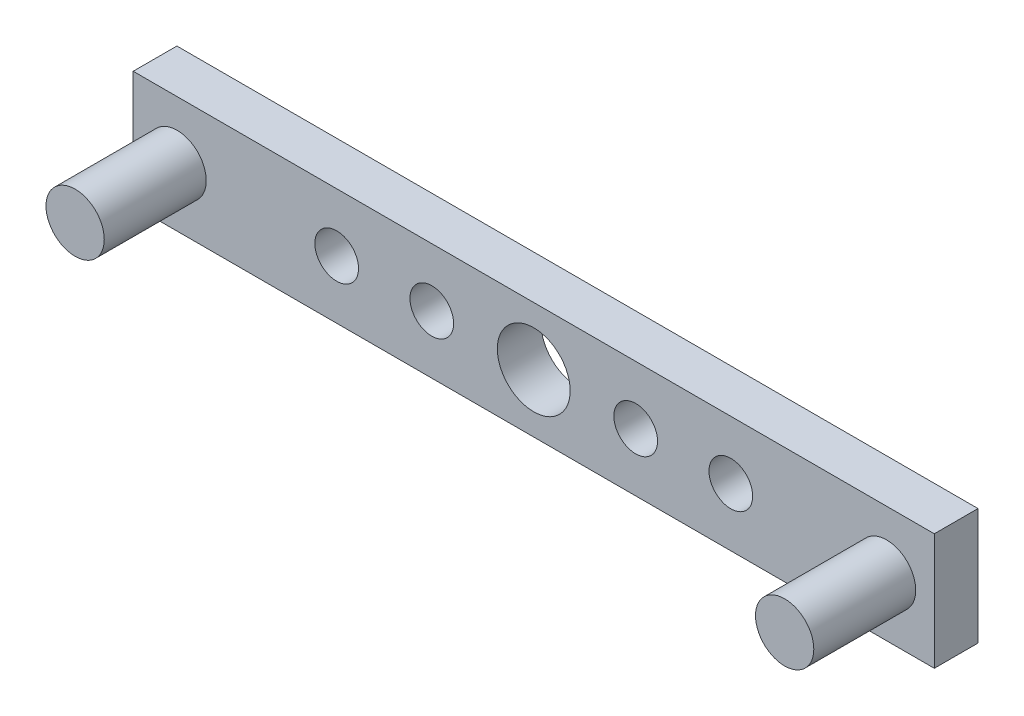
ISO-10303-21;
HEADER;
FILE_DESCRIPTION(('STEP AP214'),'2;1');
FILE_NAME('part.step','',(''),(''),'','','');
FILE_SCHEMA(('AUTOMOTIVE_DESIGN { 1 0 10303 214 1 1 1 1 }'));
ENDSEC;
DATA;
#1=APPLICATION_CONTEXT('core data for automotive mechanical design processes');
#2=APPLICATION_PROTOCOL_DEFINITION('international standard','automotive_design',2000,#1);
#3=PRODUCT_CONTEXT('',#1,'mechanical');
#4=PRODUCT('Part','Part','',(#3));
#5=PRODUCT_RELATED_PRODUCT_CATEGORY('part','',(#4));
#6=PRODUCT_DEFINITION_FORMATION('','',#4);
#7=PRODUCT_DEFINITION_CONTEXT('part definition',#1,'design');
#8=PRODUCT_DEFINITION('design','',#6,#7);
#9=PRODUCT_DEFINITION_SHAPE('','',#8);
#10=(LENGTH_UNIT() NAMED_UNIT(*) SI_UNIT(.MILLI.,.METRE.));
#11=(NAMED_UNIT(*) PLANE_ANGLE_UNIT() SI_UNIT($,.RADIAN.));
#12=(NAMED_UNIT(*) SI_UNIT($,.STERADIAN.) SOLID_ANGLE_UNIT());
#13=UNCERTAINTY_MEASURE_WITH_UNIT(LENGTH_MEASURE(1.E-05),#10,'distance_accuracy_value','');
#14=(GEOMETRIC_REPRESENTATION_CONTEXT(3) GLOBAL_UNCERTAINTY_ASSIGNED_CONTEXT((#13)) GLOBAL_UNIT_ASSIGNED_CONTEXT((#10,
#11,#12)) REPRESENTATION_CONTEXT('',''));
#15=CARTESIAN_POINT('',(0.,0.,0.));
#16=DIRECTION('',(0.,0.,1.));
#17=DIRECTION('',(1.,0.,0.));
#18=AXIS2_PLACEMENT_3D('',#15,#16,#17);
#19=CARTESIAN_POINT('',(0.,0.,3.));
#20=DIRECTION('',(1.,0.,0.));
#21=DIRECTION('',(0.,0.,-1.));
#22=AXIS2_PLACEMENT_3D('',#19,#20,#21);
#23=PLANE('',#22);
#24=DIRECTION('',(0.,-1.,0.));
#25=VECTOR('',#24,1.);
#26=CARTESIAN_POINT('',(0.,0.,0.));
#27=LINE('',#26,#25);
#28=CARTESIAN_POINT('',(0.,8.,0.));
#29=VERTEX_POINT('',#28);
#30=CARTESIAN_POINT('',(0.,0.,0.));
#31=VERTEX_POINT('',#30);
#32=EDGE_CURVE('E111',#29,#31,#27,.T.);
#33=ORIENTED_EDGE('',*,*,#32,.T.);
#34=DIRECTION('',(0.,0.,-1.));
#35=VECTOR('',#34,1.);
#36=CARTESIAN_POINT('',(0.,0.,3.));
#37=LINE('',#36,#35);
#38=CARTESIAN_POINT('',(0.,0.,3.));
#39=VERTEX_POINT('',#38);
#40=EDGE_CURVE('E42',#39,#31,#37,.T.);
#41=ORIENTED_EDGE('',*,*,#40,.F.);
#42=DIRECTION('',(0.,-1.,0.));
#43=VECTOR('',#42,1.);
#44=CARTESIAN_POINT('',(0.,0.,3.));
#45=LINE('',#44,#43);
#46=CARTESIAN_POINT('',(0.,8.,3.));
#47=VERTEX_POINT('',#46);
#48=EDGE_CURVE('E94',#47,#39,#45,.T.);
#49=ORIENTED_EDGE('',*,*,#48,.F.);
#50=DIRECTION('',(0.,0.,-1.));
#51=VECTOR('',#50,1.);
#52=CARTESIAN_POINT('',(0.,8.,3.));
#53=LINE('',#52,#51);
#54=EDGE_CURVE('E107',#47,#29,#53,.T.);
#55=ORIENTED_EDGE('',*,*,#54,.T.);
#56=EDGE_LOOP('',(#33,#41,#49,#55));
#57=FACE_BOUND('',#56,.T.);
#58=ADVANCED_FACE('F39',(#57),#23,.F.);
#59=CARTESIAN_POINT('',(0.,0.,3.));
#60=DIRECTION('',(0.,1.,0.));
#61=DIRECTION('',(0.,0.,1.));
#62=AXIS2_PLACEMENT_3D('',#59,#60,#61);
#63=PLANE('',#62);
#64=DIRECTION('',(1.,0.,0.));
#65=VECTOR('',#64,1.);
#66=CARTESIAN_POINT('',(0.,0.,0.));
#67=LINE('',#66,#65);
#68=CARTESIAN_POINT('',(55.,0.,0.));
#69=VERTEX_POINT('',#68);
#70=EDGE_CURVE('E100',#31,#69,#67,.T.);
#71=ORIENTED_EDGE('',*,*,#70,.T.);
#72=DIRECTION('',(0.,0.,-1.));
#73=VECTOR('',#72,1.);
#74=CARTESIAN_POINT('',(55.,0.,3.));
#75=LINE('',#74,#73);
#76=CARTESIAN_POINT('',(55.,0.,3.));
#77=VERTEX_POINT('',#76);
#78=EDGE_CURVE('E98',#77,#69,#75,.T.);
#79=ORIENTED_EDGE('',*,*,#78,.F.);
#80=DIRECTION('',(1.,0.,0.));
#81=VECTOR('',#80,1.);
#82=CARTESIAN_POINT('',(0.,0.,3.));
#83=LINE('',#82,#81);
#84=EDGE_CURVE('E89',#39,#77,#83,.T.);
#85=ORIENTED_EDGE('',*,*,#84,.F.);
#86=ORIENTED_EDGE('',*,*,#40,.T.);
#87=EDGE_LOOP('',(#71,#79,#85,#86));
#88=FACE_BOUND('',#87,.T.);
#89=ADVANCED_FACE('F99',(#88),#63,.F.);
#90=CARTESIAN_POINT('',(55.,0.,3.));
#91=DIRECTION('',(-1.,0.,0.));
#92=DIRECTION('',(0.,0.,1.));
#93=AXIS2_PLACEMENT_3D('',#90,#91,#92);
#94=PLANE('',#93);
#95=DIRECTION('',(0.,1.,0.));
#96=VECTOR('',#95,1.);
#97=CARTESIAN_POINT('',(55.,0.,0.));
#98=LINE('',#97,#96);
#99=CARTESIAN_POINT('',(55.,8.,0.));
#100=VERTEX_POINT('',#99);
#101=EDGE_CURVE('E75',#69,#100,#98,.T.);
#102=ORIENTED_EDGE('',*,*,#101,.T.);
#103=DIRECTION('',(0.,0.,-1.));
#104=VECTOR('',#103,1.);
#105=CARTESIAN_POINT('',(55.,8.,3.));
#106=LINE('',#105,#104);
#107=CARTESIAN_POINT('',(55.,8.,3.));
#108=VERTEX_POINT('',#107);
#109=EDGE_CURVE('E102',#108,#100,#106,.T.);
#110=ORIENTED_EDGE('',*,*,#109,.F.);
#111=DIRECTION('',(0.,1.,0.));
#112=VECTOR('',#111,1.);
#113=CARTESIAN_POINT('',(55.,0.,3.));
#114=LINE('',#113,#112);
#115=EDGE_CURVE('E92',#77,#108,#114,.T.);
#116=ORIENTED_EDGE('',*,*,#115,.F.);
#117=ORIENTED_EDGE('',*,*,#78,.T.);
#118=EDGE_LOOP('',(#102,#110,#116,#117));
#119=FACE_BOUND('',#118,.T.);
#120=ADVANCED_FACE('F103',(#119),#94,.F.);
#121=CARTESIAN_POINT('',(0.,8.,3.));
#122=DIRECTION('',(0.,-1.,0.));
#123=DIRECTION('',(0.,0.,-1.));
#124=AXIS2_PLACEMENT_3D('',#121,#122,#123);
#125=PLANE('',#124);
#126=DIRECTION('',(-1.,0.,0.));
#127=VECTOR('',#126,1.);
#128=CARTESIAN_POINT('',(0.,8.,0.));
#129=LINE('',#128,#127);
#130=EDGE_CURVE('E81',#100,#29,#129,.T.);
#131=ORIENTED_EDGE('',*,*,#130,.T.);
#132=ORIENTED_EDGE('',*,*,#54,.F.);
#133=DIRECTION('',(-1.,0.,0.));
#134=VECTOR('',#133,1.);
#135=CARTESIAN_POINT('',(0.,8.,3.));
#136=LINE('',#135,#134);
#137=EDGE_CURVE('E58',#108,#47,#136,.T.);
#138=ORIENTED_EDGE('',*,*,#137,.F.);
#139=ORIENTED_EDGE('',*,*,#109,.T.);
#140=EDGE_LOOP('',(#131,#132,#138,#139));
#141=FACE_BOUND('',#140,.T.);
#142=ADVANCED_FACE('F125',(#141),#125,.F.);
#143=CARTESIAN_POINT('',(0.,0.,3.));
#144=DIRECTION('',(0.,0.,-1.));
#145=DIRECTION('',(-1.,0.,0.));
#146=AXIS2_PLACEMENT_3D('',#143,#144,#145);
#147=PLANE('',#146);
#148=CARTESIAN_POINT('',(3.01395893534357,4.,3.));
#149=DIRECTION('',(0.,0.,-1.));
#150=DIRECTION('',(-1.,0.,0.));
#151=AXIS2_PLACEMENT_3D('',#148,#149,#150);
#152=CIRCLE('',#151,2.);
#153=CARTESIAN_POINT('',(1.01395893534357,4.,3.));
#154=VERTEX_POINT('',#153);
#155=EDGE_CURVE('E11',#154,#154,#152,.F.);
#156=ORIENTED_EDGE('',*,*,#155,.F.);
#157=EDGE_LOOP('',(#156));
#158=FACE_BOUND('',#157,.T.);
#159=CARTESIAN_POINT('',(51.7259777909675,4.,3.));
#160=DIRECTION('',(0.,0.,-1.));
#161=DIRECTION('',(-1.,0.,0.));
#162=AXIS2_PLACEMENT_3D('',#159,#160,#161);
#163=CIRCLE('',#162,2.);
#164=CARTESIAN_POINT('',(49.7259777909675,4.,3.));
#165=VERTEX_POINT('',#164);
#166=EDGE_CURVE('E49',#165,#165,#163,.F.);
#167=ORIENTED_EDGE('',*,*,#166,.F.);
#168=EDGE_LOOP('',(#167));
#169=FACE_BOUND('',#168,.T.);
#170=CARTESIAN_POINT('',(13.97,4.,3.));
#171=DIRECTION('',(0.,0.,1.));
#172=DIRECTION('',(1.,0.,0.));
#173=AXIS2_PLACEMENT_3D('',#170,#171,#172);
#174=CIRCLE('',#173,1.5);
#175=CARTESIAN_POINT('',(15.47,4.,3.));
#176=VERTEX_POINT('',#175);
#177=EDGE_CURVE('E149',#176,#176,#174,.T.);
#178=ORIENTED_EDGE('',*,*,#177,.F.);
#179=EDGE_LOOP('',(#178));
#180=FACE_BOUND('',#179,.T.);
#181=CARTESIAN_POINT('',(27.5,4.,3.));
#182=DIRECTION('',(0.,0.,1.));
#183=DIRECTION('',(1.,0.,0.));
#184=AXIS2_PLACEMENT_3D('',#181,#182,#183);
#185=CIRCLE('',#184,2.5);
#186=CARTESIAN_POINT('',(30.,4.,3.));
#187=VERTEX_POINT('',#186);
#188=EDGE_CURVE('E150',#187,#187,#185,.T.);
#189=ORIENTED_EDGE('',*,*,#188,.F.);
#190=EDGE_LOOP('',(#189));
#191=FACE_BOUND('',#190,.T.);
#192=CARTESIAN_POINT('',(34.5,4.,3.));
#193=DIRECTION('',(0.,0.,1.));
#194=DIRECTION('',(1.,0.,0.));
#195=AXIS2_PLACEMENT_3D('',#192,#193,#194);
#196=CIRCLE('',#195,1.5);
#197=CARTESIAN_POINT('',(36.,4.,3.));
#198=VERTEX_POINT('',#197);
#199=EDGE_CURVE('E159',#198,#198,#196,.T.);
#200=ORIENTED_EDGE('',*,*,#199,.F.);
#201=EDGE_LOOP('',(#200));
#202=FACE_BOUND('',#201,.T.);
#203=CARTESIAN_POINT('',(41.03,4.,3.));
#204=DIRECTION('',(0.,0.,1.));
#205=DIRECTION('',(1.,0.,0.));
#206=AXIS2_PLACEMENT_3D('',#203,#204,#205);
#207=CIRCLE('',#206,1.5);
#208=CARTESIAN_POINT('',(42.53,4.,3.));
#209=VERTEX_POINT('',#208);
#210=EDGE_CURVE('E132',#209,#209,#207,.T.);
#211=ORIENTED_EDGE('',*,*,#210,.F.);
#212=EDGE_LOOP('',(#211));
#213=FACE_BOUND('',#212,.T.);
#214=CARTESIAN_POINT('',(20.5,4.,3.));
#215=DIRECTION('',(0.,0.,1.));
#216=DIRECTION('',(1.,0.,0.));
#217=AXIS2_PLACEMENT_3D('',#214,#215,#216);
#218=CIRCLE('',#217,1.5);
#219=CARTESIAN_POINT('',(22.,4.,3.));
#220=VERTEX_POINT('',#219);
#221=EDGE_CURVE('E141',#220,#220,#218,.T.);
#222=ORIENTED_EDGE('',*,*,#221,.F.);
#223=EDGE_LOOP('',(#222));
#224=FACE_BOUND('',#223,.T.);
#225=ORIENTED_EDGE('',*,*,#48,.T.);
#226=ORIENTED_EDGE('',*,*,#84,.T.);
#227=ORIENTED_EDGE('',*,*,#115,.T.);
#228=ORIENTED_EDGE('',*,*,#137,.T.);
#229=EDGE_LOOP('',(#225,#226,#227,#228));
#230=FACE_BOUND('',#229,.T.);
#231=ADVANCED_FACE('F90',(#158,#169,#180,#191,#202,#213,#224,#230),#147,.F.);
#232=CARTESIAN_POINT('',(0.,0.,0.));
#233=DIRECTION('',(0.,0.,-1.));
#234=DIRECTION('',(-1.,0.,0.));
#235=AXIS2_PLACEMENT_3D('',#232,#233,#234);
#236=PLANE('',#235);
#237=CARTESIAN_POINT('',(13.97,4.,0.));
#238=DIRECTION('',(0.,0.,1.));
#239=DIRECTION('',(1.,0.,0.));
#240=AXIS2_PLACEMENT_3D('',#237,#238,#239);
#241=CIRCLE('',#240,1.5);
#242=CARTESIAN_POINT('',(15.47,4.,0.));
#243=VERTEX_POINT('',#242);
#244=EDGE_CURVE('E115',#243,#243,#241,.T.);
#245=ORIENTED_EDGE('',*,*,#244,.T.);
#246=EDGE_LOOP('',(#245));
#247=FACE_BOUND('',#246,.T.);
#248=CARTESIAN_POINT('',(27.5,4.,0.));
#249=DIRECTION('',(0.,0.,1.));
#250=DIRECTION('',(1.,0.,0.));
#251=AXIS2_PLACEMENT_3D('',#248,#249,#250);
#252=CIRCLE('',#251,2.5);
#253=CARTESIAN_POINT('',(30.,4.,0.));
#254=VERTEX_POINT('',#253);
#255=EDGE_CURVE('E154',#254,#254,#252,.T.);
#256=ORIENTED_EDGE('',*,*,#255,.T.);
#257=EDGE_LOOP('',(#256));
#258=FACE_BOUND('',#257,.T.);
#259=CARTESIAN_POINT('',(34.5,4.,0.));
#260=DIRECTION('',(0.,0.,1.));
#261=DIRECTION('',(1.,0.,0.));
#262=AXIS2_PLACEMENT_3D('',#259,#260,#261);
#263=CIRCLE('',#262,1.5);
#264=CARTESIAN_POINT('',(36.,4.,0.));
#265=VERTEX_POINT('',#264);
#266=EDGE_CURVE('E137',#265,#265,#263,.T.);
#267=ORIENTED_EDGE('',*,*,#266,.T.);
#268=EDGE_LOOP('',(#267));
#269=FACE_BOUND('',#268,.T.);
#270=CARTESIAN_POINT('',(41.03,4.,0.));
#271=DIRECTION('',(0.,0.,1.));
#272=DIRECTION('',(1.,0.,0.));
#273=AXIS2_PLACEMENT_3D('',#270,#271,#272);
#274=CIRCLE('',#273,1.5);
#275=CARTESIAN_POINT('',(42.53,4.,0.));
#276=VERTEX_POINT('',#275);
#277=EDGE_CURVE('E136',#276,#276,#274,.T.);
#278=ORIENTED_EDGE('',*,*,#277,.T.);
#279=EDGE_LOOP('',(#278));
#280=FACE_BOUND('',#279,.T.);
#281=CARTESIAN_POINT('',(20.5,4.,0.));
#282=DIRECTION('',(0.,0.,1.));
#283=DIRECTION('',(1.,0.,0.));
#284=AXIS2_PLACEMENT_3D('',#281,#282,#283);
#285=CIRCLE('',#284,1.5);
#286=CARTESIAN_POINT('',(22.,4.,0.));
#287=VERTEX_POINT('',#286);
#288=EDGE_CURVE('E145',#287,#287,#285,.T.);
#289=ORIENTED_EDGE('',*,*,#288,.T.);
#290=EDGE_LOOP('',(#289));
#291=FACE_BOUND('',#290,.T.);
#292=ORIENTED_EDGE('',*,*,#32,.F.);
#293=ORIENTED_EDGE('',*,*,#130,.F.);
#294=ORIENTED_EDGE('',*,*,#101,.F.);
#295=ORIENTED_EDGE('',*,*,#70,.F.);
#296=EDGE_LOOP('',(#292,#293,#294,#295));
#297=FACE_BOUND('',#296,.T.);
#298=ADVANCED_FACE('F128',(#247,#258,#269,#280,#291,#297),#236,.T.);
#299=CARTESIAN_POINT('',(20.5,4.,0.));
#300=DIRECTION('',(0.,0.,1.));
#301=DIRECTION('',(1.,0.,0.));
#302=AXIS2_PLACEMENT_3D('',#299,#300,#301);
#303=CYLINDRICAL_SURFACE('',#302,1.5);
#304=ORIENTED_EDGE('',*,*,#288,.F.);
#305=EDGE_LOOP('',(#304));
#306=FACE_BOUND('',#305,.T.);
#307=ORIENTED_EDGE('',*,*,#221,.T.);
#308=EDGE_LOOP('',(#307));
#309=FACE_BOUND('',#308,.T.);
#310=ADVANCED_FACE('F207',(#306,#309),#303,.F.);
#311=CARTESIAN_POINT('',(41.03,4.,0.));
#312=DIRECTION('',(0.,0.,1.));
#313=DIRECTION('',(1.,0.,0.));
#314=AXIS2_PLACEMENT_3D('',#311,#312,#313);
#315=CYLINDRICAL_SURFACE('',#314,1.5);
#316=ORIENTED_EDGE('',*,*,#277,.F.);
#317=EDGE_LOOP('',(#316));
#318=FACE_BOUND('',#317,.T.);
#319=ORIENTED_EDGE('',*,*,#210,.T.);
#320=EDGE_LOOP('',(#319));
#321=FACE_BOUND('',#320,.T.);
#322=ADVANCED_FACE('F209',(#318,#321),#315,.F.);
#323=CARTESIAN_POINT('',(34.5,4.,0.));
#324=DIRECTION('',(0.,0.,1.));
#325=DIRECTION('',(1.,0.,0.));
#326=AXIS2_PLACEMENT_3D('',#323,#324,#325);
#327=CYLINDRICAL_SURFACE('',#326,1.5);
#328=ORIENTED_EDGE('',*,*,#266,.F.);
#329=EDGE_LOOP('',(#328));
#330=FACE_BOUND('',#329,.T.);
#331=ORIENTED_EDGE('',*,*,#199,.T.);
#332=EDGE_LOOP('',(#331));
#333=FACE_BOUND('',#332,.T.);
#334=ADVANCED_FACE('F216',(#330,#333),#327,.F.);
#335=CARTESIAN_POINT('',(27.5,4.,0.));
#336=DIRECTION('',(0.,0.,1.));
#337=DIRECTION('',(1.,0.,0.));
#338=AXIS2_PLACEMENT_3D('',#335,#336,#337);
#339=CYLINDRICAL_SURFACE('',#338,2.5);
#340=ORIENTED_EDGE('',*,*,#255,.F.);
#341=EDGE_LOOP('',(#340));
#342=FACE_BOUND('',#341,.T.);
#343=ORIENTED_EDGE('',*,*,#188,.T.);
#344=EDGE_LOOP('',(#343));
#345=FACE_BOUND('',#344,.T.);
#346=ADVANCED_FACE('F289',(#342,#345),#339,.F.);
#347=CARTESIAN_POINT('',(13.97,4.,0.));
#348=DIRECTION('',(0.,0.,1.));
#349=DIRECTION('',(1.,0.,0.));
#350=AXIS2_PLACEMENT_3D('',#347,#348,#349);
#351=CYLINDRICAL_SURFACE('',#350,1.5);
#352=ORIENTED_EDGE('',*,*,#244,.F.);
#353=EDGE_LOOP('',(#352));
#354=FACE_BOUND('',#353,.T.);
#355=ORIENTED_EDGE('',*,*,#177,.T.);
#356=EDGE_LOOP('',(#355));
#357=FACE_BOUND('',#356,.T.);
#358=ADVANCED_FACE('F257',(#354,#357),#351,.F.);
#359=CARTESIAN_POINT('',(51.7259777909675,4.,10.));
#360=DIRECTION('',(0.,0.,-1.));
#361=DIRECTION('',(-1.,0.,0.));
#362=AXIS2_PLACEMENT_3D('',#359,#360,#361);
#363=CYLINDRICAL_SURFACE('',#362,2.);
#364=CARTESIAN_POINT('',(51.7259777909675,4.,10.));
#365=DIRECTION('',(0.,0.,1.));
#366=DIRECTION('',(1.,0.,0.));
#367=AXIS2_PLACEMENT_3D('',#364,#365,#366);
#368=CIRCLE('',#367,2.);
#369=CARTESIAN_POINT('',(53.7259777909675,4.,10.));
#370=VERTEX_POINT('',#369);
#371=EDGE_CURVE('E155',#370,#370,#368,.T.);
#372=ORIENTED_EDGE('',*,*,#371,.F.);
#373=EDGE_LOOP('',(#372));
#374=FACE_BOUND('',#373,.T.);
#375=ORIENTED_EDGE('',*,*,#166,.T.);
#376=EDGE_LOOP('',(#375));
#377=FACE_BOUND('',#376,.T.);
#378=ADVANCED_FACE('F252',(#374,#377),#363,.T.);
#379=CARTESIAN_POINT('',(51.7259777909675,4.,10.));
#380=DIRECTION('',(0.,0.,1.));
#381=DIRECTION('',(1.,0.,0.));
#382=AXIS2_PLACEMENT_3D('',#379,#380,#381);
#383=PLANE('',#382);
#384=ORIENTED_EDGE('',*,*,#371,.T.);
#385=EDGE_LOOP('',(#384));
#386=FACE_BOUND('',#385,.T.);
#387=ADVANCED_FACE('F188',(#386),#383,.T.);
#388=CARTESIAN_POINT('',(3.01395893534357,4.,10.));
#389=DIRECTION('',(0.,0.,-1.));
#390=DIRECTION('',(-1.,0.,0.));
#391=AXIS2_PLACEMENT_3D('',#388,#389,#390);
#392=CYLINDRICAL_SURFACE('',#391,2.);
#393=CARTESIAN_POINT('',(3.01395893534357,4.,10.));
#394=DIRECTION('',(0.,0.,1.));
#395=DIRECTION('',(1.,0.,0.));
#396=AXIS2_PLACEMENT_3D('',#393,#394,#395);
#397=CIRCLE('',#396,2.);
#398=CARTESIAN_POINT('',(5.01395893534357,4.,10.));
#399=VERTEX_POINT('',#398);
#400=EDGE_CURVE('E177',#399,#399,#397,.T.);
#401=ORIENTED_EDGE('',*,*,#400,.F.);
#402=EDGE_LOOP('',(#401));
#403=FACE_BOUND('',#402,.T.);
#404=ORIENTED_EDGE('',*,*,#155,.T.);
#405=EDGE_LOOP('',(#404));
#406=FACE_BOUND('',#405,.T.);
#407=ADVANCED_FACE('F185',(#403,#406),#392,.T.);
#408=CARTESIAN_POINT('',(3.01395893534357,4.,10.));
#409=DIRECTION('',(0.,0.,1.));
#410=DIRECTION('',(1.,0.,0.));
#411=AXIS2_PLACEMENT_3D('',#408,#409,#410);
#412=PLANE('',#411);
#413=ORIENTED_EDGE('',*,*,#400,.T.);
#414=EDGE_LOOP('',(#413));
#415=FACE_BOUND('',#414,.T.);
#416=ADVANCED_FACE('F183',(#415),#412,.T.);
#417=CLOSED_SHELL('',(#58,#89,#120,#142,#231,#298,#310,#322,#334,#346,#358,#378,#387,#407,#416));
#418=MANIFOLD_SOLID_BREP('B2',#417);
#419=ADVANCED_BREP_SHAPE_REPRESENTATION('',(#18,#418),#14);
#420=SHAPE_DEFINITION_REPRESENTATION(#9,#419);
ENDSEC;
END-ISO-10303-21;
